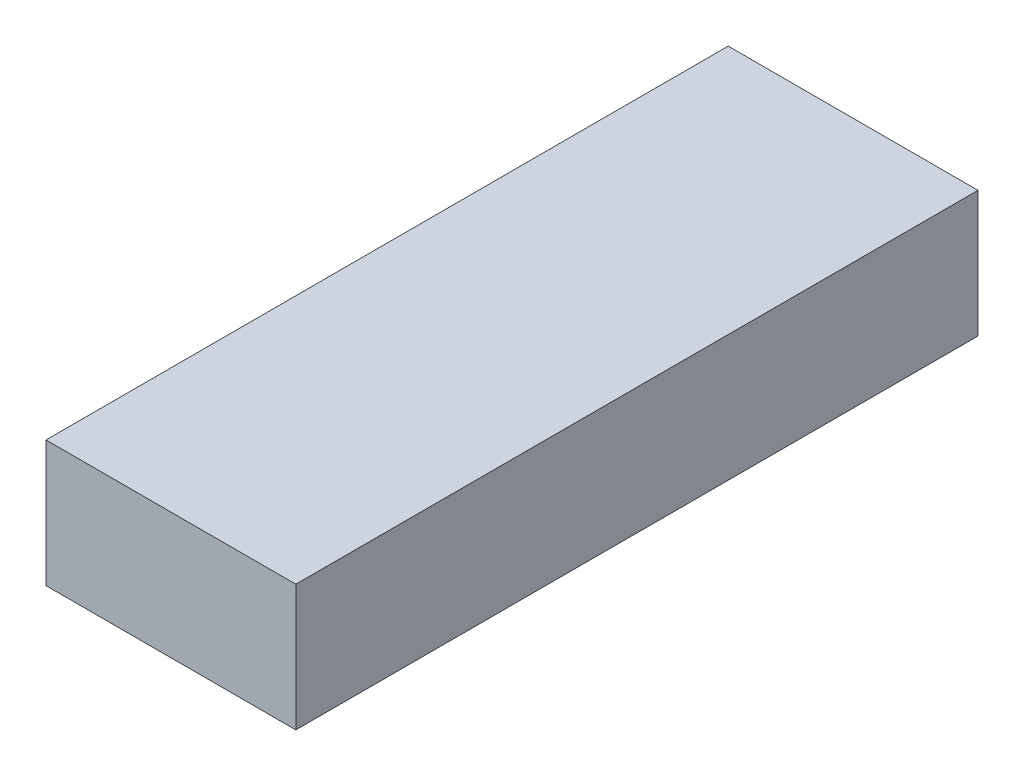
ISO-10303-21;
HEADER;
FILE_DESCRIPTION(('STEP AP214'),'2;1');
FILE_NAME('part.step','',(''),(''),'','','');
FILE_SCHEMA(('AUTOMOTIVE_DESIGN { 1 0 10303 214 1 1 1 1 }'));
ENDSEC;
DATA;
#1=APPLICATION_CONTEXT('core data for automotive mechanical design processes');
#2=APPLICATION_PROTOCOL_DEFINITION('international standard','automotive_design',2000,#1);
#3=PRODUCT_CONTEXT('',#1,'mechanical');
#4=PRODUCT('Part','Part','',(#3));
#5=PRODUCT_RELATED_PRODUCT_CATEGORY('part','',(#4));
#6=PRODUCT_DEFINITION_FORMATION('','',#4);
#7=PRODUCT_DEFINITION_CONTEXT('part definition',#1,'design');
#8=PRODUCT_DEFINITION('design','',#6,#7);
#9=PRODUCT_DEFINITION_SHAPE('','',#8);
#10=(LENGTH_UNIT() NAMED_UNIT(*) SI_UNIT(.MILLI.,.METRE.));
#11=(NAMED_UNIT(*) PLANE_ANGLE_UNIT() SI_UNIT($,.RADIAN.));
#12=(NAMED_UNIT(*) SI_UNIT($,.STERADIAN.) SOLID_ANGLE_UNIT());
#13=UNCERTAINTY_MEASURE_WITH_UNIT(LENGTH_MEASURE(1.E-05),#10,'distance_accuracy_value','');
#14=(GEOMETRIC_REPRESENTATION_CONTEXT(3) GLOBAL_UNCERTAINTY_ASSIGNED_CONTEXT((#13)) GLOBAL_UNIT_ASSIGNED_CONTEXT((#10,
#11,#12)) REPRESENTATION_CONTEXT('',''));
#15=CARTESIAN_POINT('',(0.,0.,0.));
#16=DIRECTION('',(0.,0.,1.));
#17=DIRECTION('',(1.,0.,0.));
#18=AXIS2_PLACEMENT_3D('',#15,#16,#17);
#19=CARTESIAN_POINT('',(26.,13.1318,0.));
#20=DIRECTION('',(0.,0.,-1.));
#21=DIRECTION('',(-1.,0.,0.));
#22=AXIS2_PLACEMENT_3D('',#19,#20,#21);
#23=PLANE('',#22);
#24=DIRECTION('',(1.,0.,0.));
#25=VECTOR('',#24,1.);
#26=CARTESIAN_POINT('',(26.,0.,0.));
#27=LINE('',#26,#25);
#28=CARTESIAN_POINT('',(0.,0.,0.));
#29=VERTEX_POINT('',#28);
#30=CARTESIAN_POINT('',(26.,0.,0.));
#31=VERTEX_POINT('',#30);
#32=EDGE_CURVE('E108',#29,#31,#27,.T.);
#33=ORIENTED_EDGE('',*,*,#32,.T.);
#34=DIRECTION('',(0.,-1.,0.));
#35=VECTOR('',#34,1.);
#36=CARTESIAN_POINT('',(26.,13.1318,0.));
#37=LINE('',#36,#35);
#38=CARTESIAN_POINT('',(26.,13.1318,0.));
#39=VERTEX_POINT('',#38);
#40=EDGE_CURVE('E11',#39,#31,#37,.T.);
#41=ORIENTED_EDGE('',*,*,#40,.F.);
#42=DIRECTION('',(1.,0.,0.));
#43=VECTOR('',#42,1.);
#44=CARTESIAN_POINT('',(26.,13.1318,0.));
#45=LINE('',#44,#43);
#46=CARTESIAN_POINT('',(0.,13.1318,0.));
#47=VERTEX_POINT('',#46);
#48=EDGE_CURVE('E92',#47,#39,#45,.T.);
#49=ORIENTED_EDGE('',*,*,#48,.F.);
#50=DIRECTION('',(0.,-1.,0.));
#51=VECTOR('',#50,1.);
#52=CARTESIAN_POINT('',(0.,13.1318,0.));
#53=LINE('',#52,#51);
#54=EDGE_CURVE('E104',#47,#29,#53,.T.);
#55=ORIENTED_EDGE('',*,*,#54,.T.);
#56=EDGE_LOOP('',(#33,#41,#49,#55));
#57=FACE_BOUND('',#56,.T.);
#58=ADVANCED_FACE('F39',(#57),#23,.F.);
#59=CARTESIAN_POINT('',(26.,13.1318,-71.));
#60=DIRECTION('',(-1.,0.,0.));
#61=DIRECTION('',(0.,0.,1.));
#62=AXIS2_PLACEMENT_3D('',#59,#60,#61);
#63=PLANE('',#62);
#64=DIRECTION('',(0.,0.,-1.));
#65=VECTOR('',#64,1.);
#66=CARTESIAN_POINT('',(26.,0.,-71.));
#67=LINE('',#66,#65);
#68=CARTESIAN_POINT('',(26.,0.,-71.));
#69=VERTEX_POINT('',#68);
#70=EDGE_CURVE('E97',#31,#69,#67,.T.);
#71=ORIENTED_EDGE('',*,*,#70,.T.);
#72=DIRECTION('',(0.,-1.,0.));
#73=VECTOR('',#72,1.);
#74=CARTESIAN_POINT('',(26.,13.1318,-71.));
#75=LINE('',#74,#73);
#76=CARTESIAN_POINT('',(26.,13.1318,-71.));
#77=VERTEX_POINT('',#76);
#78=EDGE_CURVE('E47',#77,#69,#75,.T.);
#79=ORIENTED_EDGE('',*,*,#78,.F.);
#80=DIRECTION('',(0.,0.,-1.));
#81=VECTOR('',#80,1.);
#82=CARTESIAN_POINT('',(26.,13.1318,-71.));
#83=LINE('',#82,#81);
#84=EDGE_CURVE('E86',#39,#77,#83,.T.);
#85=ORIENTED_EDGE('',*,*,#84,.F.);
#86=ORIENTED_EDGE('',*,*,#40,.T.);
#87=EDGE_LOOP('',(#71,#79,#85,#86));
#88=FACE_BOUND('',#87,.T.);
#89=ADVANCED_FACE('F96',(#88),#63,.F.);
#90=CARTESIAN_POINT('',(0.,13.1318,-71.));
#91=DIRECTION('',(0.,0.,1.));
#92=DIRECTION('',(1.,0.,0.));
#93=AXIS2_PLACEMENT_3D('',#90,#91,#92);
#94=PLANE('',#93);
#95=DIRECTION('',(-1.,0.,0.));
#96=VECTOR('',#95,1.);
#97=CARTESIAN_POINT('',(0.,0.,-71.));
#98=LINE('',#97,#96);
#99=CARTESIAN_POINT('',(0.,0.,-71.));
#100=VERTEX_POINT('',#99);
#101=EDGE_CURVE('E73',#69,#100,#98,.T.);
#102=ORIENTED_EDGE('',*,*,#101,.T.);
#103=DIRECTION('',(0.,-1.,0.));
#104=VECTOR('',#103,1.);
#105=CARTESIAN_POINT('',(0.,13.1318,-71.));
#106=LINE('',#105,#104);
#107=CARTESIAN_POINT('',(0.,13.1318,-71.));
#108=VERTEX_POINT('',#107);
#109=EDGE_CURVE('E99',#108,#100,#106,.T.);
#110=ORIENTED_EDGE('',*,*,#109,.F.);
#111=DIRECTION('',(-1.,0.,0.));
#112=VECTOR('',#111,1.);
#113=CARTESIAN_POINT('',(0.,13.1318,-71.));
#114=LINE('',#113,#112);
#115=EDGE_CURVE('E90',#77,#108,#114,.T.);
#116=ORIENTED_EDGE('',*,*,#115,.F.);
#117=ORIENTED_EDGE('',*,*,#78,.T.);
#118=EDGE_LOOP('',(#102,#110,#116,#117));
#119=FACE_BOUND('',#118,.T.);
#120=ADVANCED_FACE('F100',(#119),#94,.F.);
#121=CARTESIAN_POINT('',(0.,13.1318,0.));
#122=DIRECTION('',(1.,0.,0.));
#123=DIRECTION('',(0.,0.,-1.));
#124=AXIS2_PLACEMENT_3D('',#121,#122,#123);
#125=PLANE('',#124);
#126=DIRECTION('',(0.,0.,1.));
#127=VECTOR('',#126,1.);
#128=CARTESIAN_POINT('',(0.,0.,0.));
#129=LINE('',#128,#127);
#130=EDGE_CURVE('E79',#100,#29,#129,.T.);
#131=ORIENTED_EDGE('',*,*,#130,.T.);
#132=ORIENTED_EDGE('',*,*,#54,.F.);
#133=DIRECTION('',(0.,0.,1.));
#134=VECTOR('',#133,1.);
#135=CARTESIAN_POINT('',(0.,13.1318,0.));
#136=LINE('',#135,#134);
#137=EDGE_CURVE('E55',#108,#47,#136,.T.);
#138=ORIENTED_EDGE('',*,*,#137,.F.);
#139=ORIENTED_EDGE('',*,*,#109,.T.);
#140=EDGE_LOOP('',(#131,#132,#138,#139));
#141=FACE_BOUND('',#140,.T.);
#142=ADVANCED_FACE('F116',(#141),#125,.F.);
#143=CARTESIAN_POINT('',(0.,13.1318,0.));
#144=DIRECTION('',(0.,-1.,0.));
#145=DIRECTION('',(0.,0.,-1.));
#146=AXIS2_PLACEMENT_3D('',#143,#144,#145);
#147=PLANE('',#146);
#148=ORIENTED_EDGE('',*,*,#48,.T.);
#149=ORIENTED_EDGE('',*,*,#84,.T.);
#150=ORIENTED_EDGE('',*,*,#115,.T.);
#151=ORIENTED_EDGE('',*,*,#137,.T.);
#152=EDGE_LOOP('',(#148,#149,#150,#151));
#153=FACE_BOUND('',#152,.T.);
#154=ADVANCED_FACE('F88',(#153),#147,.F.);
#155=CARTESIAN_POINT('',(0.,0.,0.));
#156=DIRECTION('',(0.,-1.,0.));
#157=DIRECTION('',(0.,0.,-1.));
#158=AXIS2_PLACEMENT_3D('',#155,#156,#157);
#159=PLANE('',#158);
#160=ORIENTED_EDGE('',*,*,#32,.F.);
#161=ORIENTED_EDGE('',*,*,#130,.F.);
#162=ORIENTED_EDGE('',*,*,#101,.F.);
#163=ORIENTED_EDGE('',*,*,#70,.F.);
#164=EDGE_LOOP('',(#160,#161,#162,#163));
#165=FACE_BOUND('',#164,.T.);
#166=ADVANCED_FACE('F119',(#165),#159,.T.);
#167=CLOSED_SHELL('',(#58,#89,#120,#142,#154,#166));
#168=MANIFOLD_SOLID_BREP('B2',#167);
#169=ADVANCED_BREP_SHAPE_REPRESENTATION('',(#18,#168),#14);
#170=SHAPE_DEFINITION_REPRESENTATION(#9,#169);
ENDSEC;
END-ISO-10303-21;
